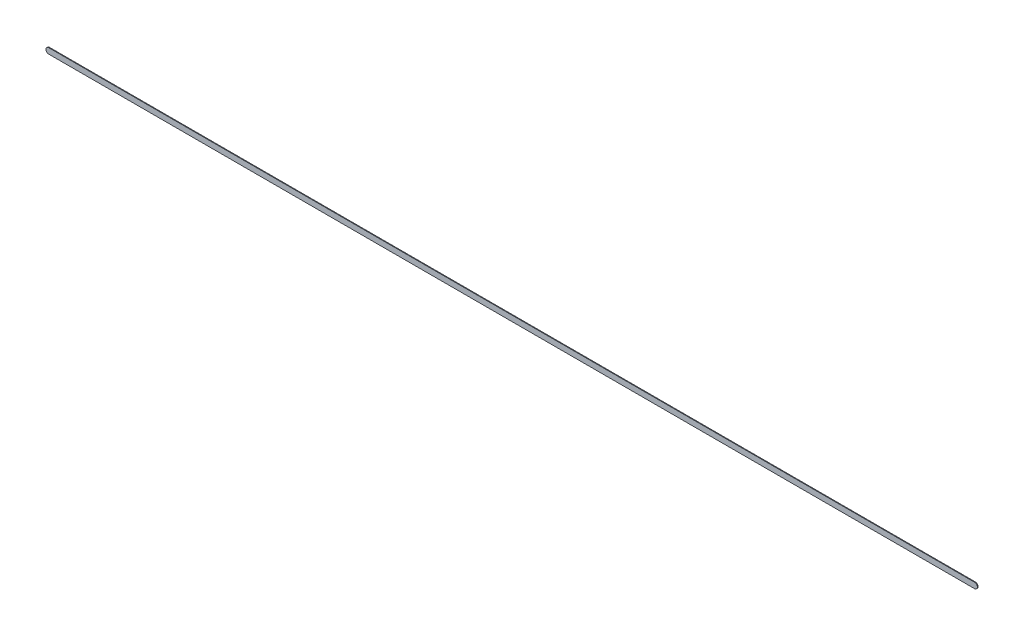
ISO-10303-21;
HEADER;
FILE_DESCRIPTION(('STEP AP214'),'2;1');
FILE_NAME('part.step','',(''),(''),'','','');
FILE_SCHEMA(('AUTOMOTIVE_DESIGN { 1 0 10303 214 1 1 1 1 }'));
ENDSEC;
DATA;
#1=APPLICATION_CONTEXT('core data for automotive mechanical design processes');
#2=APPLICATION_PROTOCOL_DEFINITION('international standard','automotive_design',2000,#1);
#3=PRODUCT_CONTEXT('',#1,'mechanical');
#4=PRODUCT('Part','Part','',(#3));
#5=PRODUCT_RELATED_PRODUCT_CATEGORY('part','',(#4));
#6=PRODUCT_DEFINITION_FORMATION('','',#4);
#7=PRODUCT_DEFINITION_CONTEXT('part definition',#1,'design');
#8=PRODUCT_DEFINITION('design','',#6,#7);
#9=PRODUCT_DEFINITION_SHAPE('','',#8);
#10=(LENGTH_UNIT() NAMED_UNIT(*) SI_UNIT(.MILLI.,.METRE.));
#11=(NAMED_UNIT(*) PLANE_ANGLE_UNIT() SI_UNIT($,.RADIAN.));
#12=(NAMED_UNIT(*) SI_UNIT($,.STERADIAN.) SOLID_ANGLE_UNIT());
#13=UNCERTAINTY_MEASURE_WITH_UNIT(LENGTH_MEASURE(1.E-05),#10,'distance_accuracy_value','');
#14=(GEOMETRIC_REPRESENTATION_CONTEXT(3) GLOBAL_UNCERTAINTY_ASSIGNED_CONTEXT((#13)) GLOBAL_UNIT_ASSIGNED_CONTEXT((#10,
#11,#12)) REPRESENTATION_CONTEXT('',''));
#15=CARTESIAN_POINT('',(0.,0.,0.));
#16=DIRECTION('',(0.,0.,1.));
#17=DIRECTION('',(1.,0.,0.));
#18=AXIS2_PLACEMENT_3D('',#15,#16,#17);
#19=CARTESIAN_POINT('',(167.727,-68.43,0.));
#20=DIRECTION('',(0.,0.,1.));
#21=DIRECTION('',(1.,0.,0.));
#22=AXIS2_PLACEMENT_3D('',#19,#20,#21);
#23=PLANE('',#22);
#24=DIRECTION('',(-1.,0.,0.));
#25=VECTOR('',#24,1.);
#26=CARTESIAN_POINT('',(167.727,-68.43,0.));
#27=LINE('',#26,#25);
#28=CARTESIAN_POINT('',(167.727,-68.43,0.));
#29=VERTEX_POINT('',#28);
#30=CARTESIAN_POINT('',(118.364,-68.43,0.));
#31=VERTEX_POINT('',#30);
#32=EDGE_CURVE('E82',#29,#31,#27,.T.);
#33=ORIENTED_EDGE('',*,*,#32,.T.);
#34=CARTESIAN_POINT('',(118.364,-68.58,0.));
#35=DIRECTION('',(0.,0.,1.));
#36=DIRECTION('',(0.,1.,0.));
#37=AXIS2_PLACEMENT_3D('',#34,#35,#36);
#38=CIRCLE('',#37,0.15);
#39=CARTESIAN_POINT('',(118.364,-68.73,0.));
#40=VERTEX_POINT('',#39);
#41=EDGE_CURVE('E105',#31,#40,#38,.T.);
#42=ORIENTED_EDGE('',*,*,#41,.T.);
#43=DIRECTION('',(1.,0.,0.));
#44=VECTOR('',#43,1.);
#45=CARTESIAN_POINT('',(118.364,-68.73,0.));
#46=LINE('',#45,#44);
#47=CARTESIAN_POINT('',(167.727,-68.73,0.));
#48=VERTEX_POINT('',#47);
#49=EDGE_CURVE('E75',#40,#48,#46,.T.);
#50=ORIENTED_EDGE('',*,*,#49,.T.);
#51=CARTESIAN_POINT('',(167.727,-68.58,0.));
#52=DIRECTION('',(0.,0.,1.));
#53=DIRECTION('',(-1.894780628694E-13,-1.,0.));
#54=AXIS2_PLACEMENT_3D('',#51,#52,#53);
#55=CIRCLE('',#54,0.15);
#56=EDGE_CURVE('E11',#48,#29,#55,.T.);
#57=ORIENTED_EDGE('',*,*,#56,.T.);
#58=EDGE_LOOP('',(#33,#42,#50,#57));
#59=FACE_BOUND('',#58,.T.);
#60=ADVANCED_FACE('F17',(#59),#23,.T.);
#61=CARTESIAN_POINT('',(167.727,-68.43,-0.035));
#62=DIRECTION('',(0.,0.,1.));
#63=DIRECTION('',(1.,0.,0.));
#64=AXIS2_PLACEMENT_3D('',#61,#62,#63);
#65=PLANE('',#64);
#66=CARTESIAN_POINT('',(167.727,-68.58,-0.035));
#67=DIRECTION('',(0.,0.,1.));
#68=DIRECTION('',(-1.894780628694E-13,-1.,0.));
#69=AXIS2_PLACEMENT_3D('',#66,#67,#68);
#70=CIRCLE('',#69,0.15);
#71=CARTESIAN_POINT('',(167.727,-68.73,-0.035));
#72=VERTEX_POINT('',#71);
#73=CARTESIAN_POINT('',(167.727,-68.43,-0.035));
#74=VERTEX_POINT('',#73);
#75=EDGE_CURVE('E20',#72,#74,#70,.T.);
#76=ORIENTED_EDGE('',*,*,#75,.F.);
#77=DIRECTION('',(1.,0.,0.));
#78=VECTOR('',#77,1.);
#79=CARTESIAN_POINT('',(118.364,-68.73,-0.035));
#80=LINE('',#79,#78);
#81=CARTESIAN_POINT('',(118.364,-68.73,-0.035));
#82=VERTEX_POINT('',#81);
#83=EDGE_CURVE('E102',#82,#72,#80,.T.);
#84=ORIENTED_EDGE('',*,*,#83,.F.);
#85=CARTESIAN_POINT('',(118.364,-68.58,-0.035));
#86=DIRECTION('',(0.,0.,1.));
#87=DIRECTION('',(0.,1.,0.));
#88=AXIS2_PLACEMENT_3D('',#85,#86,#87);
#89=CIRCLE('',#88,0.15);
#90=CARTESIAN_POINT('',(118.364,-68.43,-0.035));
#91=VERTEX_POINT('',#90);
#92=EDGE_CURVE('E84',#91,#82,#89,.T.);
#93=ORIENTED_EDGE('',*,*,#92,.F.);
#94=DIRECTION('',(-1.,0.,0.));
#95=VECTOR('',#94,1.);
#96=CARTESIAN_POINT('',(167.727,-68.43,-0.035));
#97=LINE('',#96,#95);
#98=EDGE_CURVE('E80',#74,#91,#97,.T.);
#99=ORIENTED_EDGE('',*,*,#98,.F.);
#100=EDGE_LOOP('',(#76,#84,#93,#99));
#101=FACE_BOUND('',#100,.T.);
#102=ADVANCED_FACE('F86',(#101),#65,.F.);
#103=CARTESIAN_POINT('',(167.727,-68.58,-0.035));
#104=DIRECTION('',(0.,0.,-1.));
#105=DIRECTION('',(-1.894780628694E-13,-1.,0.));
#106=AXIS2_PLACEMENT_3D('',#103,#104,#105);
#107=CYLINDRICAL_SURFACE('',#106,0.15);
#108=ORIENTED_EDGE('',*,*,#75,.T.);
#109=DIRECTION('',(0.,0.,1.));
#110=VECTOR('',#109,1.);
#111=CARTESIAN_POINT('',(167.727,-68.43,-0.035));
#112=LINE('',#111,#110);
#113=EDGE_CURVE('E69',#74,#29,#112,.T.);
#114=ORIENTED_EDGE('',*,*,#113,.T.);
#115=ORIENTED_EDGE('',*,*,#56,.F.);
#116=DIRECTION('',(0.,0.,1.));
#117=VECTOR('',#116,1.);
#118=CARTESIAN_POINT('',(167.727,-68.73,-0.035));
#119=LINE('',#118,#117);
#120=EDGE_CURVE('E72',#72,#48,#119,.T.);
#121=ORIENTED_EDGE('',*,*,#120,.F.);
#122=EDGE_LOOP('',(#108,#114,#115,#121));
#123=FACE_BOUND('',#122,.T.);
#124=ADVANCED_FACE('F68',(#123),#107,.T.);
#125=CARTESIAN_POINT('',(118.364,-68.73,-0.035));
#126=DIRECTION('',(0.,1.,0.));
#127=DIRECTION('',(1.,0.,0.));
#128=AXIS2_PLACEMENT_3D('',#125,#126,#127);
#129=PLANE('',#128);
#130=ORIENTED_EDGE('',*,*,#83,.T.);
#131=ORIENTED_EDGE('',*,*,#120,.T.);
#132=ORIENTED_EDGE('',*,*,#49,.F.);
#133=DIRECTION('',(0.,0.,1.));
#134=VECTOR('',#133,1.);
#135=CARTESIAN_POINT('',(118.364,-68.73,-0.035));
#136=LINE('',#135,#134);
#137=EDGE_CURVE('E106',#82,#40,#136,.T.);
#138=ORIENTED_EDGE('',*,*,#137,.F.);
#139=EDGE_LOOP('',(#130,#131,#132,#138));
#140=FACE_BOUND('',#139,.T.);
#141=ADVANCED_FACE('F118',(#140),#129,.F.);
#142=CARTESIAN_POINT('',(118.364,-68.58,-0.035));
#143=DIRECTION('',(0.,0.,-1.));
#144=DIRECTION('',(0.,1.,0.));
#145=AXIS2_PLACEMENT_3D('',#142,#143,#144);
#146=CYLINDRICAL_SURFACE('',#145,0.15);
#147=ORIENTED_EDGE('',*,*,#92,.T.);
#148=ORIENTED_EDGE('',*,*,#137,.T.);
#149=ORIENTED_EDGE('',*,*,#41,.F.);
#150=DIRECTION('',(0.,0.,1.));
#151=VECTOR('',#150,1.);
#152=CARTESIAN_POINT('',(118.364,-68.43,-0.035));
#153=LINE('',#152,#151);
#154=EDGE_CURVE('E90',#91,#31,#153,.T.);
#155=ORIENTED_EDGE('',*,*,#154,.F.);
#156=EDGE_LOOP('',(#147,#148,#149,#155));
#157=FACE_BOUND('',#156,.T.);
#158=ADVANCED_FACE('F120',(#157),#146,.T.);
#159=CARTESIAN_POINT('',(167.727,-68.43,-0.035));
#160=DIRECTION('',(0.,-1.,0.));
#161=DIRECTION('',(0.,0.,-1.));
#162=AXIS2_PLACEMENT_3D('',#159,#160,#161);
#163=PLANE('',#162);
#164=ORIENTED_EDGE('',*,*,#98,.T.);
#165=ORIENTED_EDGE('',*,*,#154,.T.);
#166=ORIENTED_EDGE('',*,*,#32,.F.);
#167=ORIENTED_EDGE('',*,*,#113,.F.);
#168=EDGE_LOOP('',(#164,#165,#166,#167));
#169=FACE_BOUND('',#168,.T.);
#170=ADVANCED_FACE('F78',(#169),#163,.F.);
#171=CLOSED_SHELL('',(#60,#102,#124,#141,#158,#170));
#172=MANIFOLD_SOLID_BREP('B1',#171);
#173=ADVANCED_BREP_SHAPE_REPRESENTATION('',(#18,#172),#14);
#174=SHAPE_DEFINITION_REPRESENTATION(#9,#173);
ENDSEC;
END-ISO-10303-21;
